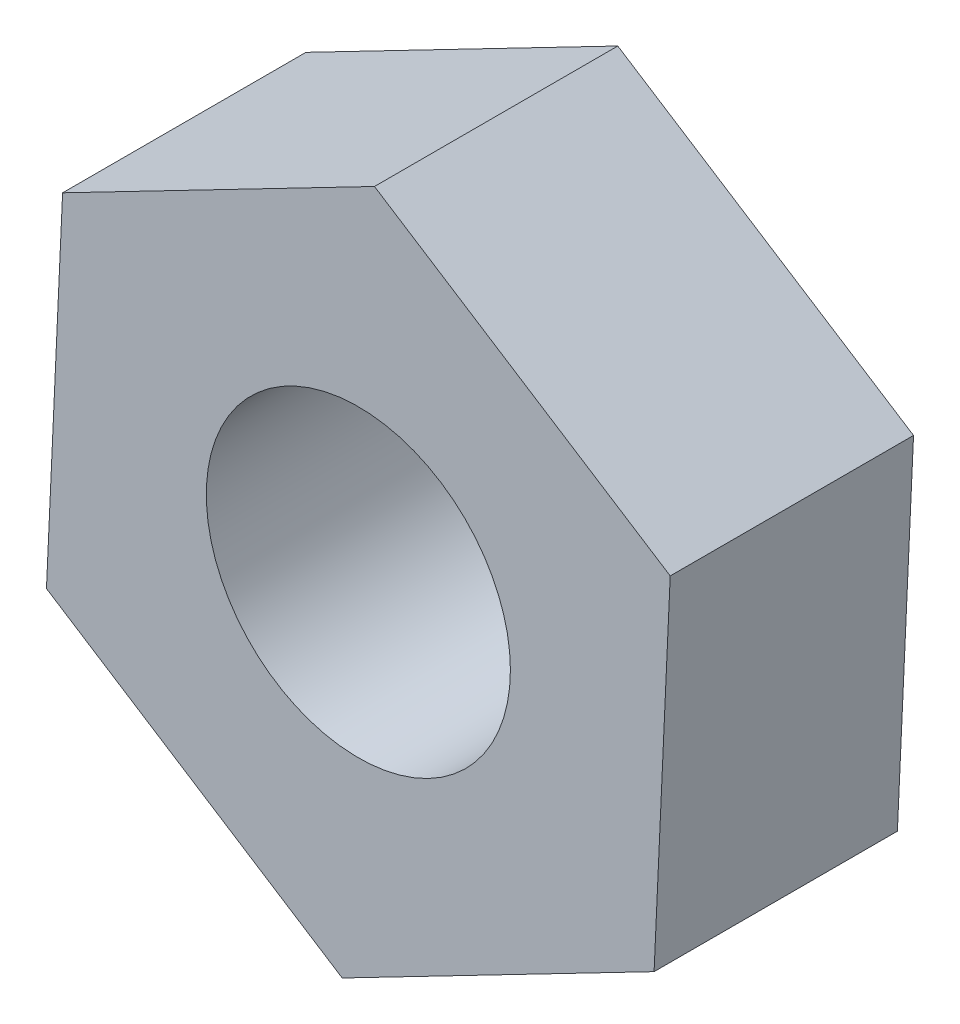
ISO-10303-21;
HEADER;
FILE_DESCRIPTION(('STEP AP214'),'2;1');
FILE_NAME('part.step','',(''),(''),'','','');
FILE_SCHEMA(('AUTOMOTIVE_DESIGN { 1 0 10303 214 1 1 1 1 }'));
ENDSEC;
DATA;
#1=APPLICATION_CONTEXT('core data for automotive mechanical design processes');
#2=APPLICATION_PROTOCOL_DEFINITION('international standard','automotive_design',2000,#1);
#3=PRODUCT_CONTEXT('',#1,'mechanical');
#4=PRODUCT('Part','Part','',(#3));
#5=PRODUCT_RELATED_PRODUCT_CATEGORY('part','',(#4));
#6=PRODUCT_DEFINITION_FORMATION('','',#4);
#7=PRODUCT_DEFINITION_CONTEXT('part definition',#1,'design');
#8=PRODUCT_DEFINITION('design','',#6,#7);
#9=PRODUCT_DEFINITION_SHAPE('','',#8);
#10=(LENGTH_UNIT() NAMED_UNIT(*) SI_UNIT(.MILLI.,.METRE.));
#11=(NAMED_UNIT(*) PLANE_ANGLE_UNIT() SI_UNIT($,.RADIAN.));
#12=(NAMED_UNIT(*) SI_UNIT($,.STERADIAN.) SOLID_ANGLE_UNIT());
#13=UNCERTAINTY_MEASURE_WITH_UNIT(LENGTH_MEASURE(1.E-05),#10,'distance_accuracy_value','');
#14=(GEOMETRIC_REPRESENTATION_CONTEXT(3) GLOBAL_UNCERTAINTY_ASSIGNED_CONTEXT((#13)) GLOBAL_UNIT_ASSIGNED_CONTEXT((#10,
#11,#12)) REPRESENTATION_CONTEXT('',''));
#15=CARTESIAN_POINT('',(0.,0.,0.));
#16=DIRECTION('',(0.,0.,1.));
#17=DIRECTION('',(1.,0.,0.));
#18=AXIS2_PLACEMENT_3D('',#15,#16,#17);
#19=CARTESIAN_POINT('',(0.,0.,1.6));
#20=DIRECTION('',(0.,0.,1.));
#21=DIRECTION('',(1.,0.,0.));
#22=AXIS2_PLACEMENT_3D('',#19,#20,#21);
#23=PLANE('',#22);
#24=DIRECTION('',(-0.0459498793532355,-0.998943746457939,0.));
#25=VECTOR('',#24,1.);
#26=CARTESIAN_POINT('',(-1.94482914248823,1.24538064055204,1.6));
#27=LINE('',#26,#25);
#28=CARTESIAN_POINT('',(-1.94482914248823,1.24538064055204,1.6));
#29=VERTEX_POINT('',#28);
#30=CARTESIAN_POINT('',(-2.05094584334352,-1.0615811231391,1.6));
#31=VERTEX_POINT('',#30);
#32=EDGE_CURVE('E130',#29,#31,#27,.T.);
#33=ORIENTED_EDGE('',*,*,#32,.T.);
#34=DIRECTION('',(0.842135721707559,-0.539265636049701,0.));
#35=VECTOR('',#34,1.);
#36=CARTESIAN_POINT('',(-2.05094584334352,-1.0615811231391,1.6));
#37=LINE('',#36,#35);
#38=CARTESIAN_POINT('',(-0.106116700855284,-2.30696176369114,1.6));
#39=VERTEX_POINT('',#38);
#40=EDGE_CURVE('E88',#31,#39,#37,.T.);
#41=ORIENTED_EDGE('',*,*,#40,.T.);
#42=DIRECTION('',(0.888085601060794,0.459678110408238,0.));
#43=VECTOR('',#42,1.);
#44=CARTESIAN_POINT('',(-0.106116700855284,-2.30696176369114,1.6));
#45=LINE('',#44,#43);
#46=CARTESIAN_POINT('',(1.94482914248824,-1.24538064055204,1.6));
#47=VERTEX_POINT('',#46);
#48=EDGE_CURVE('E101',#39,#47,#45,.T.);
#49=ORIENTED_EDGE('',*,*,#48,.T.);
#50=DIRECTION('',(0.0459498793532353,0.998943746457939,0.));
#51=VECTOR('',#50,1.);
#52=CARTESIAN_POINT('',(1.94482914248824,-1.24538064055204,1.6));
#53=LINE('',#52,#51);
#54=CARTESIAN_POINT('',(2.05094584334352,1.0615811231391,1.6));
#55=VERTEX_POINT('',#54);
#56=EDGE_CURVE('E95',#47,#55,#53,.T.);
#57=ORIENTED_EDGE('',*,*,#56,.T.);
#58=DIRECTION('',(-0.842135721707559,0.539265636049701,0.));
#59=VECTOR('',#58,1.);
#60=CARTESIAN_POINT('',(2.05094584334352,1.0615811231391,1.6));
#61=LINE('',#60,#59);
#62=CARTESIAN_POINT('',(0.106116700855285,2.30696176369114,1.6));
#63=VERTEX_POINT('',#62);
#64=EDGE_CURVE('E99',#55,#63,#61,.T.);
#65=ORIENTED_EDGE('',*,*,#64,.T.);
#66=DIRECTION('',(-0.888085601060794,-0.459678110408238,0.));
#67=VECTOR('',#66,1.);
#68=CARTESIAN_POINT('',(0.106116700855285,2.30696176369114,1.6));
#69=LINE('',#68,#67);
#70=EDGE_CURVE('E51',#63,#29,#69,.T.);
#71=ORIENTED_EDGE('',*,*,#70,.T.);
#72=EDGE_LOOP('',(#33,#41,#49,#57,#65,#71));
#73=FACE_BOUND('',#72,.T.);
#74=CARTESIAN_POINT('',(0.,0.,1.6));
#75=DIRECTION('',(0.,0.,1.));
#76=DIRECTION('',(1.,0.,0.));
#77=AXIS2_PLACEMENT_3D('',#74,#75,#76);
#78=CIRCLE('',#77,1.);
#79=CARTESIAN_POINT('',(1.,0.,1.6));
#80=VERTEX_POINT('',#79);
#81=EDGE_CURVE('E123',#80,#80,#78,.T.);
#82=ORIENTED_EDGE('',*,*,#81,.F.);
#83=EDGE_LOOP('',(#82));
#84=FACE_BOUND('',#83,.T.);
#85=ADVANCED_FACE('F34',(#73,#84),#23,.T.);
#86=CARTESIAN_POINT('',(0.,0.,0.));
#87=DIRECTION('',(0.,0.,1.));
#88=DIRECTION('',(1.,0.,0.));
#89=AXIS2_PLACEMENT_3D('',#86,#87,#88);
#90=PLANE('',#89);
#91=DIRECTION('',(-0.0459498793532355,-0.998943746457939,0.));
#92=VECTOR('',#91,1.);
#93=CARTESIAN_POINT('',(-1.94482914248823,1.24538064055204,0.));
#94=LINE('',#93,#92);
#95=CARTESIAN_POINT('',(-1.94482914248823,1.24538064055204,0.));
#96=VERTEX_POINT('',#95);
#97=CARTESIAN_POINT('',(-2.05094584334352,-1.0615811231391,0.));
#98=VERTEX_POINT('',#97);
#99=EDGE_CURVE('E119',#96,#98,#94,.T.);
#100=ORIENTED_EDGE('',*,*,#99,.F.);
#101=DIRECTION('',(-0.888085601060794,-0.459678110408238,0.));
#102=VECTOR('',#101,1.);
#103=CARTESIAN_POINT('',(0.106116700855285,2.30696176369114,0.));
#104=LINE('',#103,#102);
#105=CARTESIAN_POINT('',(0.106116700855285,2.30696176369114,0.));
#106=VERTEX_POINT('',#105);
#107=EDGE_CURVE('E80',#106,#96,#104,.T.);
#108=ORIENTED_EDGE('',*,*,#107,.F.);
#109=DIRECTION('',(-0.842135721707559,0.539265636049701,0.));
#110=VECTOR('',#109,1.);
#111=CARTESIAN_POINT('',(2.05094584334352,1.0615811231391,0.));
#112=LINE('',#111,#110);
#113=CARTESIAN_POINT('',(2.05094584334352,1.0615811231391,0.));
#114=VERTEX_POINT('',#113);
#115=EDGE_CURVE('E74',#114,#106,#112,.T.);
#116=ORIENTED_EDGE('',*,*,#115,.F.);
#117=DIRECTION('',(0.0459498793532353,0.998943746457939,0.));
#118=VECTOR('',#117,1.);
#119=CARTESIAN_POINT('',(1.94482914248824,-1.24538064055204,0.));
#120=LINE('',#119,#118);
#121=CARTESIAN_POINT('',(1.94482914248824,-1.24538064055204,0.));
#122=VERTEX_POINT('',#121);
#123=EDGE_CURVE('E109',#122,#114,#120,.T.);
#124=ORIENTED_EDGE('',*,*,#123,.F.);
#125=DIRECTION('',(0.888085601060794,0.459678110408238,0.));
#126=VECTOR('',#125,1.);
#127=CARTESIAN_POINT('',(-0.106116700855284,-2.30696176369114,0.));
#128=LINE('',#127,#126);
#129=CARTESIAN_POINT('',(-0.106116700855284,-2.30696176369114,0.));
#130=VERTEX_POINT('',#129);
#131=EDGE_CURVE('E125',#130,#122,#128,.T.);
#132=ORIENTED_EDGE('',*,*,#131,.F.);
#133=DIRECTION('',(0.842135721707559,-0.539265636049701,0.));
#134=VECTOR('',#133,1.);
#135=CARTESIAN_POINT('',(-2.05094584334352,-1.0615811231391,0.));
#136=LINE('',#135,#134);
#137=EDGE_CURVE('E122',#98,#130,#136,.T.);
#138=ORIENTED_EDGE('',*,*,#137,.F.);
#139=EDGE_LOOP('',(#100,#108,#116,#124,#132,#138));
#140=FACE_BOUND('',#139,.T.);
#141=CARTESIAN_POINT('',(0.,0.,0.));
#142=DIRECTION('',(0.,0.,1.));
#143=DIRECTION('',(1.,0.,0.));
#144=AXIS2_PLACEMENT_3D('',#141,#142,#143);
#145=CIRCLE('',#144,1.);
#146=CARTESIAN_POINT('',(1.,0.,0.));
#147=VERTEX_POINT('',#146);
#148=EDGE_CURVE('E223',#147,#147,#145,.T.);
#149=ORIENTED_EDGE('',*,*,#148,.T.);
#150=EDGE_LOOP('',(#149));
#151=FACE_BOUND('',#150,.T.);
#152=ADVANCED_FACE('F139',(#140,#151),#90,.F.);
#153=CARTESIAN_POINT('',(-1.94482914248823,1.24538064055204,1.6));
#154=DIRECTION('',(0.998943746457939,-0.0459498793532355,0.));
#155=DIRECTION('',(0.0459498793532355,0.998943746457939,0.));
#156=AXIS2_PLACEMENT_3D('',#153,#154,#155);
#157=PLANE('',#156);
#158=ORIENTED_EDGE('',*,*,#99,.T.);
#159=DIRECTION('',(0.,0.,-1.));
#160=VECTOR('',#159,1.);
#161=CARTESIAN_POINT('',(-2.05094584334352,-1.0615811231391,1.6));
#162=LINE('',#161,#160);
#163=EDGE_CURVE('E11',#31,#98,#162,.T.);
#164=ORIENTED_EDGE('',*,*,#163,.F.);
#165=ORIENTED_EDGE('',*,*,#32,.F.);
#166=DIRECTION('',(0.,0.,-1.));
#167=VECTOR('',#166,1.);
#168=CARTESIAN_POINT('',(-1.94482914248823,1.24538064055204,1.6));
#169=LINE('',#168,#167);
#170=EDGE_CURVE('E115',#29,#96,#169,.T.);
#171=ORIENTED_EDGE('',*,*,#170,.T.);
#172=EDGE_LOOP('',(#158,#164,#165,#171));
#173=FACE_BOUND('',#172,.T.);
#174=ADVANCED_FACE('F36',(#173),#157,.F.);
#175=CARTESIAN_POINT('',(-2.05094584334352,-1.0615811231391,1.6));
#176=DIRECTION('',(0.539265636049701,0.842135721707559,0.));
#177=DIRECTION('',(-0.842135721707559,0.539265636049701,0.));
#178=AXIS2_PLACEMENT_3D('',#175,#176,#177);
#179=PLANE('',#178);
#180=ORIENTED_EDGE('',*,*,#137,.T.);
#181=DIRECTION('',(0.,0.,-1.));
#182=VECTOR('',#181,1.);
#183=CARTESIAN_POINT('',(-0.106116700855284,-2.30696176369114,1.6));
#184=LINE('',#183,#182);
#185=EDGE_CURVE('E43',#39,#130,#184,.T.);
#186=ORIENTED_EDGE('',*,*,#185,.F.);
#187=ORIENTED_EDGE('',*,*,#40,.F.);
#188=ORIENTED_EDGE('',*,*,#163,.T.);
#189=EDGE_LOOP('',(#180,#186,#187,#188));
#190=FACE_BOUND('',#189,.T.);
#191=ADVANCED_FACE('F164',(#190),#179,.F.);
#192=CARTESIAN_POINT('',(-0.106116700855284,-2.30696176369114,1.6));
#193=DIRECTION('',(-0.459678110408238,0.888085601060794,0.));
#194=DIRECTION('',(-0.888085601060794,-0.459678110408238,0.));
#195=AXIS2_PLACEMENT_3D('',#192,#193,#194);
#196=PLANE('',#195);
#197=ORIENTED_EDGE('',*,*,#131,.T.);
#198=DIRECTION('',(0.,0.,-1.));
#199=VECTOR('',#198,1.);
#200=CARTESIAN_POINT('',(1.94482914248824,-1.24538064055204,1.6));
#201=LINE('',#200,#199);
#202=EDGE_CURVE('E110',#47,#122,#201,.T.);
#203=ORIENTED_EDGE('',*,*,#202,.F.);
#204=ORIENTED_EDGE('',*,*,#48,.F.);
#205=ORIENTED_EDGE('',*,*,#185,.T.);
#206=EDGE_LOOP('',(#197,#203,#204,#205));
#207=FACE_BOUND('',#206,.T.);
#208=ADVANCED_FACE('F136',(#207),#196,.F.);
#209=CARTESIAN_POINT('',(1.94482914248824,-1.24538064055204,1.6));
#210=DIRECTION('',(-0.998943746457939,0.0459498793532353,0.));
#211=DIRECTION('',(-0.0459498793532353,-0.998943746457939,0.));
#212=AXIS2_PLACEMENT_3D('',#209,#210,#211);
#213=PLANE('',#212);
#214=ORIENTED_EDGE('',*,*,#123,.T.);
#215=DIRECTION('',(0.,0.,-1.));
#216=VECTOR('',#215,1.);
#217=CARTESIAN_POINT('',(2.05094584334352,1.0615811231391,1.6));
#218=LINE('',#217,#216);
#219=EDGE_CURVE('E106',#55,#114,#218,.T.);
#220=ORIENTED_EDGE('',*,*,#219,.F.);
#221=ORIENTED_EDGE('',*,*,#56,.F.);
#222=ORIENTED_EDGE('',*,*,#202,.T.);
#223=EDGE_LOOP('',(#214,#220,#221,#222));
#224=FACE_BOUND('',#223,.T.);
#225=ADVANCED_FACE('F107',(#224),#213,.F.);
#226=CARTESIAN_POINT('',(2.05094584334352,1.0615811231391,1.6));
#227=DIRECTION('',(-0.539265636049701,-0.842135721707559,0.));
#228=DIRECTION('',(0.842135721707559,-0.539265636049701,0.));
#229=AXIS2_PLACEMENT_3D('',#226,#227,#228);
#230=PLANE('',#229);
#231=ORIENTED_EDGE('',*,*,#115,.T.);
#232=DIRECTION('',(0.,0.,-1.));
#233=VECTOR('',#232,1.);
#234=CARTESIAN_POINT('',(0.106116700855285,2.30696176369114,1.6));
#235=LINE('',#234,#233);
#236=EDGE_CURVE('E111',#63,#106,#235,.T.);
#237=ORIENTED_EDGE('',*,*,#236,.F.);
#238=ORIENTED_EDGE('',*,*,#64,.F.);
#239=ORIENTED_EDGE('',*,*,#219,.T.);
#240=EDGE_LOOP('',(#231,#237,#238,#239));
#241=FACE_BOUND('',#240,.T.);
#242=ADVANCED_FACE('F113',(#241),#230,.F.);
#243=CARTESIAN_POINT('',(0.106116700855285,2.30696176369114,1.6));
#244=DIRECTION('',(0.459678110408238,-0.888085601060794,0.));
#245=DIRECTION('',(0.888085601060794,0.459678110408238,0.));
#246=AXIS2_PLACEMENT_3D('',#243,#244,#245);
#247=PLANE('',#246);
#248=ORIENTED_EDGE('',*,*,#107,.T.);
#249=ORIENTED_EDGE('',*,*,#170,.F.);
#250=ORIENTED_EDGE('',*,*,#70,.F.);
#251=ORIENTED_EDGE('',*,*,#236,.T.);
#252=EDGE_LOOP('',(#248,#249,#250,#251));
#253=FACE_BOUND('',#252,.T.);
#254=ADVANCED_FACE('F144',(#253),#247,.F.);
#255=CARTESIAN_POINT('',(0.,0.,1.6));
#256=DIRECTION('',(0.,0.,-1.));
#257=DIRECTION('',(-1.,0.,0.));
#258=AXIS2_PLACEMENT_3D('',#255,#256,#257);
#259=CYLINDRICAL_SURFACE('',#258,1.);
#260=ORIENTED_EDGE('',*,*,#81,.T.);
#261=EDGE_LOOP('',(#260));
#262=FACE_BOUND('',#261,.T.);
#263=ORIENTED_EDGE('',*,*,#148,.F.);
#264=EDGE_LOOP('',(#263));
#265=FACE_BOUND('',#264,.T.);
#266=ADVANCED_FACE('F146',(#262,#265),#259,.F.);
#267=CLOSED_SHELL('',(#85,#152,#174,#191,#208,#225,#242,#254,#266));
#268=MANIFOLD_SOLID_BREP('B2',#267);
#269=ADVANCED_BREP_SHAPE_REPRESENTATION('',(#18,#268),#14);
#270=SHAPE_DEFINITION_REPRESENTATION(#9,#269);
ENDSEC;
END-ISO-10303-21;
